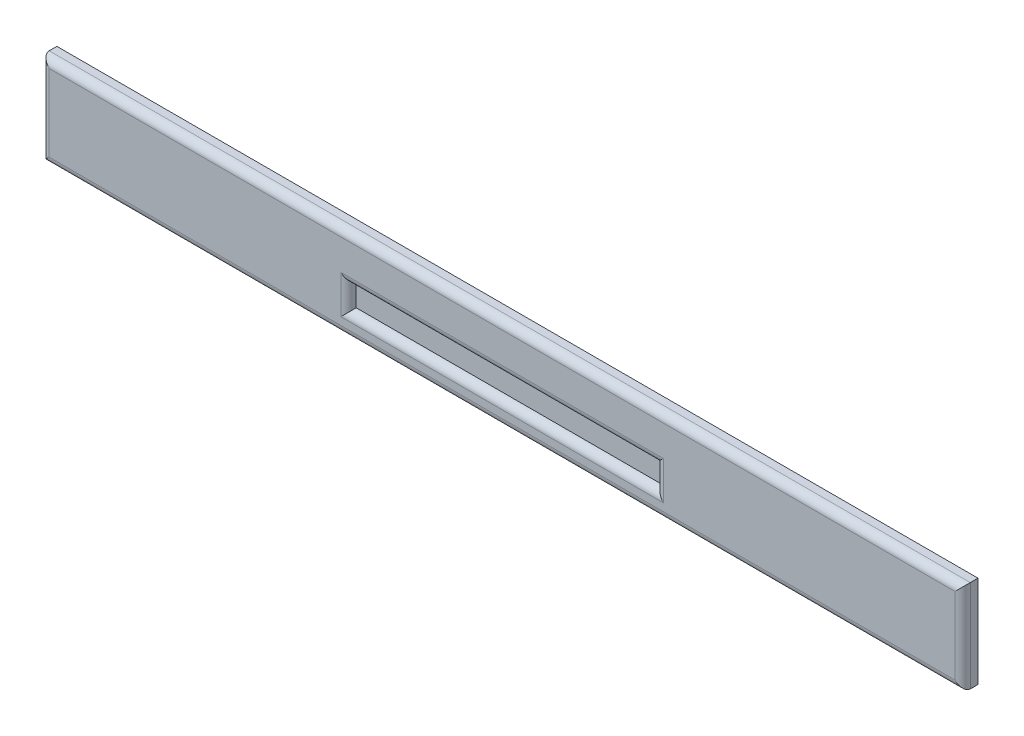
ISO-10303-21;
HEADER;
FILE_DESCRIPTION(('STEP AP214'),'2;1');
FILE_NAME('part.step','',(''),(''),'','','');
FILE_SCHEMA(('AUTOMOTIVE_DESIGN { 1 0 10303 214 1 1 1 1 }'));
ENDSEC;
DATA;
#1=APPLICATION_CONTEXT('core data for automotive mechanical design processes');
#2=APPLICATION_PROTOCOL_DEFINITION('international standard','automotive_design',2000,#1);
#3=PRODUCT_CONTEXT('',#1,'mechanical');
#4=PRODUCT('Part','Part','',(#3));
#5=PRODUCT_RELATED_PRODUCT_CATEGORY('part','',(#4));
#6=PRODUCT_DEFINITION_FORMATION('','',#4);
#7=PRODUCT_DEFINITION_CONTEXT('part definition',#1,'design');
#8=PRODUCT_DEFINITION('design','',#6,#7);
#9=PRODUCT_DEFINITION_SHAPE('','',#8);
#10=(LENGTH_UNIT() NAMED_UNIT(*) SI_UNIT(.MILLI.,.METRE.));
#11=(NAMED_UNIT(*) PLANE_ANGLE_UNIT() SI_UNIT($,.RADIAN.));
#12=(NAMED_UNIT(*) SI_UNIT($,.STERADIAN.) SOLID_ANGLE_UNIT());
#13=UNCERTAINTY_MEASURE_WITH_UNIT(LENGTH_MEASURE(1.E-05),#10,'distance_accuracy_value','');
#14=(GEOMETRIC_REPRESENTATION_CONTEXT(3) GLOBAL_UNCERTAINTY_ASSIGNED_CONTEXT((#13)) GLOBAL_UNIT_ASSIGNED_CONTEXT((#10,
#11,#12)) REPRESENTATION_CONTEXT('',''));
#15=CARTESIAN_POINT('',(0.,0.,0.));
#16=DIRECTION('',(0.,0.,1.));
#17=DIRECTION('',(1.,0.,0.));
#18=AXIS2_PLACEMENT_3D('',#15,#16,#17);
#19=CARTESIAN_POINT('',(0.,0.,100.));
#20=DIRECTION('',(-1.,0.,0.));
#21=DIRECTION('',(0.,0.,1.));
#22=AXIS2_PLACEMENT_3D('',#19,#20,#21);
#23=PLANE('',#22);
#24=DIRECTION('',(0.,0.,-1.));
#25=VECTOR('',#24,1.);
#26=CARTESIAN_POINT('',(0.,600.,100.));
#27=LINE('',#26,#25);
#28=CARTESIAN_POINT('',(0.,600.,50.));
#29=VERTEX_POINT('',#28);
#30=CARTESIAN_POINT('',(0.,600.,0.));
#31=VERTEX_POINT('',#30);
#32=EDGE_CURVE('E165',#29,#31,#27,.T.);
#33=ORIENTED_EDGE('',*,*,#32,.F.);
#34=DIRECTION('',(0.,1.,0.));
#35=VECTOR('',#34,1.);
#36=CARTESIAN_POINT('',(0.,0.,50.));
#37=LINE('',#36,#35);
#38=CARTESIAN_POINT('',(0.,0.,50.));
#39=VERTEX_POINT('',#38);
#40=EDGE_CURVE('E11',#29,#39,#37,.F.);
#41=ORIENTED_EDGE('',*,*,#40,.T.);
#42=DIRECTION('',(0.,0.,-1.));
#43=VECTOR('',#42,1.);
#44=CARTESIAN_POINT('',(0.,0.,100.));
#45=LINE('',#44,#43);
#46=CARTESIAN_POINT('',(0.,0.,0.));
#47=VERTEX_POINT('',#46);
#48=EDGE_CURVE('E159',#39,#47,#45,.T.);
#49=ORIENTED_EDGE('',*,*,#48,.T.);
#50=DIRECTION('',(0.,1.,0.));
#51=VECTOR('',#50,1.);
#52=CARTESIAN_POINT('',(0.,0.,0.));
#53=LINE('',#52,#51);
#54=EDGE_CURVE('E147',#47,#31,#53,.T.);
#55=ORIENTED_EDGE('',*,*,#54,.T.);
#56=EDGE_LOOP('',(#33,#41,#49,#55));
#57=FACE_BOUND('',#56,.T.);
#58=ADVANCED_FACE('F39',(#57),#23,.F.);
#59=CARTESIAN_POINT('',(0.,600.,100.));
#60=DIRECTION('',(0.,-1.,0.));
#61=DIRECTION('',(1.,0.,0.));
#62=AXIS2_PLACEMENT_3D('',#59,#60,#61);
#63=PLANE('',#62);
#64=DIRECTION('',(0.,0.,-1.));
#65=VECTOR('',#64,1.);
#66=CARTESIAN_POINT('',(-6000.,599.999999999999,100.));
#67=LINE('',#66,#65);
#68=CARTESIAN_POINT('',(-6000.,599.999999999999,50.));
#69=VERTEX_POINT('',#68);
#70=CARTESIAN_POINT('',(-6000.,599.999999999999,0.));
#71=VERTEX_POINT('',#70);
#72=EDGE_CURVE('E163',#69,#71,#67,.T.);
#73=ORIENTED_EDGE('',*,*,#72,.F.);
#74=DIRECTION('',(-1.,0.,0.));
#75=VECTOR('',#74,1.);
#76=CARTESIAN_POINT('',(0.,600.,50.));
#77=LINE('',#76,#75);
#78=EDGE_CURVE('E48',#69,#29,#77,.F.);
#79=ORIENTED_EDGE('',*,*,#78,.T.);
#80=ORIENTED_EDGE('',*,*,#32,.T.);
#81=DIRECTION('',(-1.,0.,0.));
#82=VECTOR('',#81,1.);
#83=CARTESIAN_POINT('',(0.,600.,0.));
#84=LINE('',#83,#82);
#85=EDGE_CURVE('E150',#31,#71,#84,.T.);
#86=ORIENTED_EDGE('',*,*,#85,.T.);
#87=EDGE_LOOP('',(#73,#79,#80,#86));
#88=FACE_BOUND('',#87,.T.);
#89=ADVANCED_FACE('F214',(#88),#63,.F.);
#90=CARTESIAN_POINT('',(-6000.,0.,100.));
#91=DIRECTION('',(1.,0.,0.));
#92=DIRECTION('',(0.,1.,0.));
#93=AXIS2_PLACEMENT_3D('',#90,#91,#92);
#94=PLANE('',#93);
#95=DIRECTION('',(0.,0.,-1.));
#96=VECTOR('',#95,1.);
#97=CARTESIAN_POINT('',(-6000.,0.,100.));
#98=LINE('',#97,#96);
#99=CARTESIAN_POINT('',(-6000.,0.,50.));
#100=VERTEX_POINT('',#99);
#101=CARTESIAN_POINT('',(-6000.,0.,0.));
#102=VERTEX_POINT('',#101);
#103=EDGE_CURVE('E161',#100,#102,#98,.T.);
#104=ORIENTED_EDGE('',*,*,#103,.F.);
#105=DIRECTION('',(0.,-1.,0.));
#106=VECTOR('',#105,1.);
#107=CARTESIAN_POINT('',(-6000.,599.999999999999,50.));
#108=LINE('',#107,#106);
#109=EDGE_CURVE('E63',#100,#69,#108,.F.);
#110=ORIENTED_EDGE('',*,*,#109,.T.);
#111=ORIENTED_EDGE('',*,*,#72,.T.);
#112=DIRECTION('',(0.,-1.,0.));
#113=VECTOR('',#112,1.);
#114=CARTESIAN_POINT('',(-6000.,0.,0.));
#115=LINE('',#114,#113);
#116=EDGE_CURVE('E153',#71,#102,#115,.T.);
#117=ORIENTED_EDGE('',*,*,#116,.T.);
#118=EDGE_LOOP('',(#104,#110,#111,#117));
#119=FACE_BOUND('',#118,.T.);
#120=ADVANCED_FACE('F220',(#119),#94,.F.);
#121=CARTESIAN_POINT('',(0.,0.,100.));
#122=DIRECTION('',(0.,1.,0.));
#123=DIRECTION('',(0.,0.,1.));
#124=AXIS2_PLACEMENT_3D('',#121,#122,#123);
#125=PLANE('',#124);
#126=ORIENTED_EDGE('',*,*,#48,.F.);
#127=DIRECTION('',(1.,0.,0.));
#128=VECTOR('',#127,1.);
#129=CARTESIAN_POINT('',(-6000.,0.,50.));
#130=LINE('',#129,#128);
#131=EDGE_CURVE('E183',#39,#100,#130,.F.);
#132=ORIENTED_EDGE('',*,*,#131,.T.);
#133=ORIENTED_EDGE('',*,*,#103,.T.);
#134=DIRECTION('',(1.,0.,0.));
#135=VECTOR('',#134,1.);
#136=CARTESIAN_POINT('',(0.,0.,0.));
#137=LINE('',#136,#135);
#138=EDGE_CURVE('E156',#102,#47,#137,.T.);
#139=ORIENTED_EDGE('',*,*,#138,.T.);
#140=EDGE_LOOP('',(#126,#132,#133,#139));
#141=FACE_BOUND('',#140,.T.);
#142=ADVANCED_FACE('F253',(#141),#125,.F.);
#143=CARTESIAN_POINT('',(0.,0.,100.));
#144=DIRECTION('',(0.,0.,1.));
#145=DIRECTION('',(1.,0.,0.));
#146=AXIS2_PLACEMENT_3D('',#143,#144,#145);
#147=PLANE('',#146);
#148=DIRECTION('',(0.,-1.,0.));
#149=VECTOR('',#148,1.);
#150=CARTESIAN_POINT('',(-5950.,0.,100.));
#151=LINE('',#150,#149);
#152=CARTESIAN_POINT('',(-5950.,549.999999999999,100.));
#153=VERTEX_POINT('',#152);
#154=CARTESIAN_POINT('',(-5950.,50.,100.));
#155=VERTEX_POINT('',#154);
#156=EDGE_CURVE('E178',#153,#155,#151,.T.);
#157=ORIENTED_EDGE('',*,*,#156,.T.);
#158=DIRECTION('',(1.,0.,0.));
#159=VECTOR('',#158,1.);
#160=CARTESIAN_POINT('',(0.,50.,100.));
#161=LINE('',#160,#159);
#162=CARTESIAN_POINT('',(-50.,50.,100.));
#163=VERTEX_POINT('',#162);
#164=EDGE_CURVE('E180',#155,#163,#161,.T.);
#165=ORIENTED_EDGE('',*,*,#164,.T.);
#166=DIRECTION('',(0.,1.,0.));
#167=VECTOR('',#166,1.);
#168=CARTESIAN_POINT('',(-50.,600.,100.));
#169=LINE('',#168,#167);
#170=CARTESIAN_POINT('',(-50.,550.,100.));
#171=VERTEX_POINT('',#170);
#172=EDGE_CURVE('E174',#163,#171,#169,.T.);
#173=ORIENTED_EDGE('',*,*,#172,.T.);
#174=DIRECTION('',(-1.,0.,0.));
#175=VECTOR('',#174,1.);
#176=CARTESIAN_POINT('',(-6000.,549.999999999999,100.));
#177=LINE('',#176,#175);
#178=EDGE_CURVE('E176',#171,#153,#177,.T.);
#179=ORIENTED_EDGE('',*,*,#178,.T.);
#180=EDGE_LOOP('',(#157,#165,#173,#179));
#181=FACE_BOUND('',#180,.T.);
#182=DIRECTION('',(0.,-1.,0.));
#183=VECTOR('',#182,1.);
#184=CARTESIAN_POINT('',(-4050.,300.,100.));
#185=LINE('',#184,#183);
#186=CARTESIAN_POINT('',(-4050.,100.,100.));
#187=VERTEX_POINT('',#186);
#188=CARTESIAN_POINT('',(-4050.,350.,100.));
#189=VERTEX_POINT('',#188);
#190=EDGE_CURVE('E170',#187,#189,#185,.F.);
#191=ORIENTED_EDGE('',*,*,#190,.T.);
#192=DIRECTION('',(-1.,0.,0.));
#193=VECTOR('',#192,1.);
#194=CARTESIAN_POINT('',(-2000.,350.,100.));
#195=LINE('',#194,#193);
#196=CARTESIAN_POINT('',(-1950.,350.,100.));
#197=VERTEX_POINT('',#196);
#198=EDGE_CURVE('E172',#189,#197,#195,.F.);
#199=ORIENTED_EDGE('',*,*,#198,.T.);
#200=DIRECTION('',(0.,1.,0.));
#201=VECTOR('',#200,1.);
#202=CARTESIAN_POINT('',(-1950.,150.,100.));
#203=LINE('',#202,#201);
#204=CARTESIAN_POINT('',(-1950.,100.,100.));
#205=VERTEX_POINT('',#204);
#206=EDGE_CURVE('E132',#197,#205,#203,.F.);
#207=ORIENTED_EDGE('',*,*,#206,.T.);
#208=DIRECTION('',(1.,0.,0.));
#209=VECTOR('',#208,1.);
#210=CARTESIAN_POINT('',(-4000.,100.,100.));
#211=LINE('',#210,#209);
#212=EDGE_CURVE('E168',#205,#187,#211,.F.);
#213=ORIENTED_EDGE('',*,*,#212,.T.);
#214=EDGE_LOOP('',(#191,#199,#207,#213));
#215=FACE_BOUND('',#214,.T.);
#216=ADVANCED_FACE('F204',(#181,#215),#147,.T.);
#217=CARTESIAN_POINT('',(0.,0.,0.));
#218=DIRECTION('',(0.,0.,1.));
#219=DIRECTION('',(1.,0.,0.));
#220=AXIS2_PLACEMENT_3D('',#217,#218,#219);
#221=PLANE('',#220);
#222=ORIENTED_EDGE('',*,*,#54,.F.);
#223=ORIENTED_EDGE('',*,*,#138,.F.);
#224=ORIENTED_EDGE('',*,*,#116,.F.);
#225=ORIENTED_EDGE('',*,*,#85,.F.);
#226=EDGE_LOOP('',(#222,#223,#224,#225));
#227=FACE_BOUND('',#226,.T.);
#228=ADVANCED_FACE('F242',(#227),#221,.F.);
#229=CARTESIAN_POINT('',(0.,0.,50.));
#230=DIRECTION('',(0.,0.,-1.));
#231=DIRECTION('',(-1.,0.,0.));
#232=AXIS2_PLACEMENT_3D('',#229,#230,#231);
#233=PLANE('',#232);
#234=DIRECTION('',(0.,1.,0.));
#235=VECTOR('',#234,1.);
#236=CARTESIAN_POINT('',(-2000.,150.,50.));
#237=LINE('',#236,#235);
#238=CARTESIAN_POINT('',(-2000.,150.,50.));
#239=VERTEX_POINT('',#238);
#240=CARTESIAN_POINT('',(-2000.,300.,50.));
#241=VERTEX_POINT('',#240);
#242=EDGE_CURVE('E117',#239,#241,#237,.T.);
#243=ORIENTED_EDGE('',*,*,#242,.T.);
#244=DIRECTION('',(-1.,0.,0.));
#245=VECTOR('',#244,1.);
#246=CARTESIAN_POINT('',(-4000.,300.,50.));
#247=LINE('',#246,#245);
#248=CARTESIAN_POINT('',(-4000.,300.,50.));
#249=VERTEX_POINT('',#248);
#250=EDGE_CURVE('E121',#241,#249,#247,.T.);
#251=ORIENTED_EDGE('',*,*,#250,.T.);
#252=DIRECTION('',(0.,-1.,0.));
#253=VECTOR('',#252,1.);
#254=CARTESIAN_POINT('',(-4000.,150.,50.));
#255=LINE('',#254,#253);
#256=CARTESIAN_POINT('',(-4000.,150.,50.));
#257=VERTEX_POINT('',#256);
#258=EDGE_CURVE('E142',#249,#257,#255,.T.);
#259=ORIENTED_EDGE('',*,*,#258,.T.);
#260=DIRECTION('',(1.,0.,0.));
#261=VECTOR('',#260,1.);
#262=CARTESIAN_POINT('',(-4000.,150.,50.));
#263=LINE('',#262,#261);
#264=EDGE_CURVE('E123',#257,#239,#263,.T.);
#265=ORIENTED_EDGE('',*,*,#264,.T.);
#266=EDGE_LOOP('',(#243,#251,#259,#265));
#267=FACE_BOUND('',#266,.T.);
#268=ADVANCED_FACE('F119',(#267),#233,.F.);
#269=CARTESIAN_POINT('',(0.,550.,50.));
#270=DIRECTION('',(1.,0.,0.));
#271=DIRECTION('',(0.,1.,0.));
#272=AXIS2_PLACEMENT_3D('',#269,#270,#271);
#273=CYLINDRICAL_SURFACE('',#272,50.);
#274=CARTESIAN_POINT('',(-50.,550.,50.));
#275=DIRECTION('',(0.707106781186548,-0.707106781186547,0.));
#276=DIRECTION('',(-0.707106781186547,-0.707106781186548,0.));
#277=AXIS2_PLACEMENT_3D('',#274,#275,#276);
#278=ELLIPSE('',#277,70.7106781186548,50.);
#279=EDGE_CURVE('E192',#29,#171,#278,.T.);
#280=ORIENTED_EDGE('',*,*,#279,.F.);
#281=ORIENTED_EDGE('',*,*,#78,.F.);
#282=CARTESIAN_POINT('',(-5950.,549.999999999999,50.));
#283=DIRECTION('',(0.707106781186548,0.707106781186547,0.));
#284=DIRECTION('',(0.707106781186547,-0.707106781186548,0.));
#285=AXIS2_PLACEMENT_3D('',#282,#283,#284);
#286=ELLIPSE('',#285,70.7106781186547,50.);
#287=EDGE_CURVE('E127',#153,#69,#286,.F.);
#288=ORIENTED_EDGE('',*,*,#287,.F.);
#289=ORIENTED_EDGE('',*,*,#178,.F.);
#290=EDGE_LOOP('',(#280,#281,#288,#289));
#291=FACE_BOUND('',#290,.T.);
#292=ADVANCED_FACE('F235',(#291),#273,.T.);
#293=CARTESIAN_POINT('',(-5950.,8.80776932869292E-12,50.));
#294=DIRECTION('',(0.,1.,0.));
#295=DIRECTION('',(-1.,0.,0.));
#296=AXIS2_PLACEMENT_3D('',#293,#294,#295);
#297=CYLINDRICAL_SURFACE('',#296,50.);
#298=ORIENTED_EDGE('',*,*,#287,.T.);
#299=ORIENTED_EDGE('',*,*,#109,.F.);
#300=CARTESIAN_POINT('',(-5950.,50.,50.));
#301=DIRECTION('',(-0.707106781186547,0.707106781186548,0.));
#302=DIRECTION('',(0.707106781186548,0.707106781186547,0.));
#303=AXIS2_PLACEMENT_3D('',#300,#301,#302);
#304=ELLIPSE('',#303,70.7106781186548,50.);
#305=EDGE_CURVE('E190',#155,#100,#304,.F.);
#306=ORIENTED_EDGE('',*,*,#305,.F.);
#307=ORIENTED_EDGE('',*,*,#156,.F.);
#308=EDGE_LOOP('',(#298,#299,#306,#307));
#309=FACE_BOUND('',#308,.T.);
#310=ADVANCED_FACE('F231',(#309),#297,.T.);
#311=CARTESIAN_POINT('',(-50.,0.,50.));
#312=DIRECTION('',(0.,-1.,0.));
#313=DIRECTION('',(0.,0.,-1.));
#314=AXIS2_PLACEMENT_3D('',#311,#312,#313);
#315=CYLINDRICAL_SURFACE('',#314,50.);
#316=ORIENTED_EDGE('',*,*,#279,.T.);
#317=ORIENTED_EDGE('',*,*,#172,.F.);
#318=CARTESIAN_POINT('',(-50.,50.,50.));
#319=DIRECTION('',(-0.707106781186547,-0.707106781186547,0.));
#320=DIRECTION('',(0.707106781186547,-0.707106781186547,0.));
#321=AXIS2_PLACEMENT_3D('',#318,#319,#320);
#322=ELLIPSE('',#321,70.7106781186548,50.);
#323=EDGE_CURVE('E188',#39,#163,#322,.T.);
#324=ORIENTED_EDGE('',*,*,#323,.F.);
#325=ORIENTED_EDGE('',*,*,#40,.F.);
#326=EDGE_LOOP('',(#316,#317,#324,#325));
#327=FACE_BOUND('',#326,.T.);
#328=ADVANCED_FACE('F227',(#327),#315,.T.);
#329=CARTESIAN_POINT('',(0.,50.,50.));
#330=DIRECTION('',(-1.,0.,0.));
#331=DIRECTION('',(0.,0.,1.));
#332=AXIS2_PLACEMENT_3D('',#329,#330,#331);
#333=CYLINDRICAL_SURFACE('',#332,50.);
#334=ORIENTED_EDGE('',*,*,#305,.T.);
#335=ORIENTED_EDGE('',*,*,#131,.F.);
#336=ORIENTED_EDGE('',*,*,#323,.T.);
#337=ORIENTED_EDGE('',*,*,#164,.F.);
#338=EDGE_LOOP('',(#334,#335,#336,#337));
#339=FACE_BOUND('',#338,.T.);
#340=ADVANCED_FACE('F224',(#339),#333,.T.);
#341=CARTESIAN_POINT('',(-4000.,100.,50.));
#342=DIRECTION('',(-1.,0.,0.));
#343=DIRECTION('',(0.,0.,1.));
#344=AXIS2_PLACEMENT_3D('',#341,#342,#343);
#345=CYLINDRICAL_SURFACE('',#344,50.);
#346=CARTESIAN_POINT('',(-4050.,100.,50.));
#347=DIRECTION('',(-0.707106781186547,0.707106781186547,0.));
#348=DIRECTION('',(0.707106781186547,0.707106781186547,0.));
#349=AXIS2_PLACEMENT_3D('',#346,#347,#348);
#350=ELLIPSE('',#349,70.7106781186548,50.);
#351=EDGE_CURVE('E136',#187,#257,#350,.T.);
#352=ORIENTED_EDGE('',*,*,#351,.F.);
#353=ORIENTED_EDGE('',*,*,#212,.F.);
#354=CARTESIAN_POINT('',(-1950.,100.,50.));
#355=DIRECTION('',(-0.707106781186547,-0.707106781186547,0.));
#356=DIRECTION('',(-0.707106781186547,0.707106781186547,0.));
#357=AXIS2_PLACEMENT_3D('',#354,#355,#356);
#358=ELLIPSE('',#357,70.7106781186548,50.);
#359=EDGE_CURVE('E43',#239,#205,#358,.F.);
#360=ORIENTED_EDGE('',*,*,#359,.F.);
#361=ORIENTED_EDGE('',*,*,#264,.F.);
#362=EDGE_LOOP('',(#352,#353,#360,#361));
#363=FACE_BOUND('',#362,.T.);
#364=ADVANCED_FACE('F41',(#363),#345,.T.);
#365=CARTESIAN_POINT('',(-1950.,150.,50.));
#366=DIRECTION('',(0.,-1.,0.));
#367=DIRECTION('',(0.,0.,-1.));
#368=AXIS2_PLACEMENT_3D('',#365,#366,#367);
#369=CYLINDRICAL_SURFACE('',#368,50.);
#370=ORIENTED_EDGE('',*,*,#359,.T.);
#371=ORIENTED_EDGE('',*,*,#206,.F.);
#372=CARTESIAN_POINT('',(-1950.,350.,50.));
#373=DIRECTION('',(0.707106781186547,-0.707106781186547,0.));
#374=DIRECTION('',(0.707106781186547,0.707106781186547,0.));
#375=AXIS2_PLACEMENT_3D('',#372,#373,#374);
#376=ELLIPSE('',#375,70.7106781186548,50.);
#377=EDGE_CURVE('E130',#241,#197,#376,.F.);
#378=ORIENTED_EDGE('',*,*,#377,.F.);
#379=ORIENTED_EDGE('',*,*,#242,.F.);
#380=EDGE_LOOP('',(#370,#371,#378,#379));
#381=FACE_BOUND('',#380,.T.);
#382=ADVANCED_FACE('F131',(#381),#369,.T.);
#383=CARTESIAN_POINT('',(-4050.,150.,50.));
#384=DIRECTION('',(0.,1.,0.));
#385=DIRECTION('',(0.,0.,1.));
#386=AXIS2_PLACEMENT_3D('',#383,#384,#385);
#387=CYLINDRICAL_SURFACE('',#386,50.);
#388=ORIENTED_EDGE('',*,*,#351,.T.);
#389=ORIENTED_EDGE('',*,*,#258,.F.);
#390=CARTESIAN_POINT('',(-4050.,350.,50.));
#391=DIRECTION('',(0.707106781186547,0.707106781186547,0.));
#392=DIRECTION('',(0.707106781186547,-0.707106781186547,0.));
#393=AXIS2_PLACEMENT_3D('',#390,#391,#392);
#394=ELLIPSE('',#393,70.7106781186548,50.);
#395=EDGE_CURVE('E137',#189,#249,#394,.T.);
#396=ORIENTED_EDGE('',*,*,#395,.F.);
#397=ORIENTED_EDGE('',*,*,#190,.F.);
#398=EDGE_LOOP('',(#388,#389,#396,#397));
#399=FACE_BOUND('',#398,.T.);
#400=ADVANCED_FACE('F205',(#399),#387,.T.);
#401=CARTESIAN_POINT('',(-4000.,350.,50.));
#402=DIRECTION('',(1.,0.,0.));
#403=DIRECTION('',(0.,0.,-1.));
#404=AXIS2_PLACEMENT_3D('',#401,#402,#403);
#405=CYLINDRICAL_SURFACE('',#404,50.);
#406=ORIENTED_EDGE('',*,*,#377,.T.);
#407=ORIENTED_EDGE('',*,*,#198,.F.);
#408=ORIENTED_EDGE('',*,*,#395,.T.);
#409=ORIENTED_EDGE('',*,*,#250,.F.);
#410=EDGE_LOOP('',(#406,#407,#408,#409));
#411=FACE_BOUND('',#410,.T.);
#412=ADVANCED_FACE('F139',(#411),#405,.T.);
#413=CLOSED_SHELL('',(#58,#89,#120,#142,#216,#228,#268,#292,#310,#328,#340,#364,#382,#400,#412));
#414=MANIFOLD_SOLID_BREP('B2',#413);
#415=ADVANCED_BREP_SHAPE_REPRESENTATION('',(#18,#414),#14);
#416=SHAPE_DEFINITION_REPRESENTATION(#9,#415);
ENDSEC;
END-ISO-10303-21;
